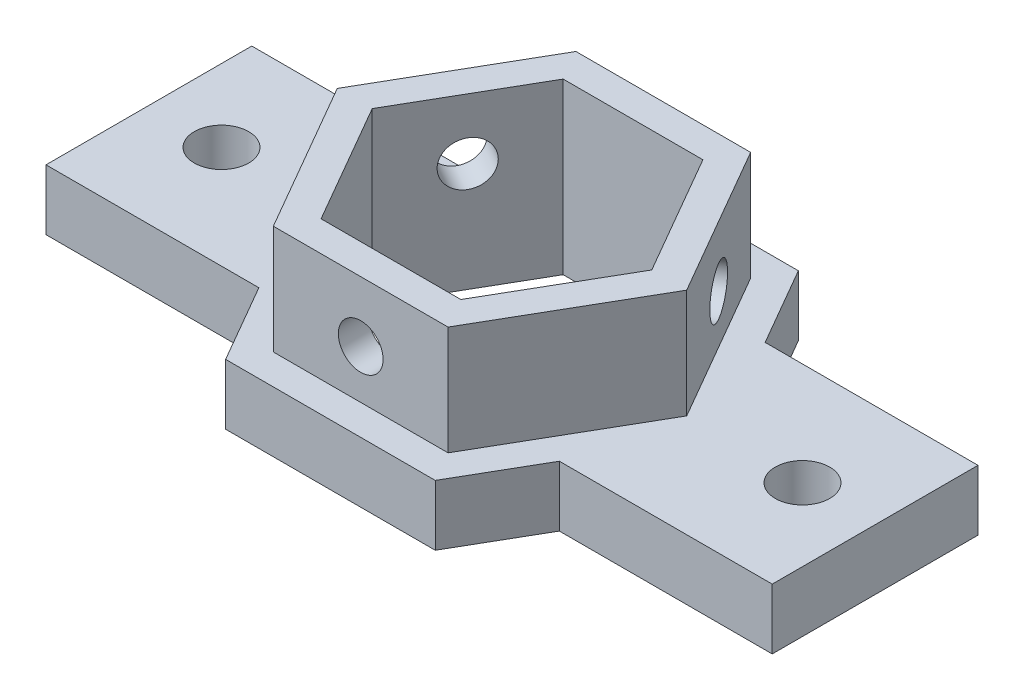
ISO-10303-21;
HEADER;
FILE_DESCRIPTION(('STEP AP214'),'2;1');
FILE_NAME('part.step','',(''),(''),'','','');
FILE_SCHEMA(('AUTOMOTIVE_DESIGN { 1 0 10303 214 1 1 1 1 }'));
ENDSEC;
DATA;
#1=APPLICATION_CONTEXT('core data for automotive mechanical design processes');
#2=APPLICATION_PROTOCOL_DEFINITION('international standard','automotive_design',2000,#1);
#3=PRODUCT_CONTEXT('',#1,'mechanical');
#4=PRODUCT('Part','Part','',(#3));
#5=PRODUCT_RELATED_PRODUCT_CATEGORY('part','',(#4));
#6=PRODUCT_DEFINITION_FORMATION('','',#4);
#7=PRODUCT_DEFINITION_CONTEXT('part definition',#1,'design');
#8=PRODUCT_DEFINITION('design','',#6,#7);
#9=PRODUCT_DEFINITION_SHAPE('','',#8);
#10=(LENGTH_UNIT() NAMED_UNIT(*) SI_UNIT(.MILLI.,.METRE.));
#11=(NAMED_UNIT(*) PLANE_ANGLE_UNIT() SI_UNIT($,.RADIAN.));
#12=(NAMED_UNIT(*) SI_UNIT($,.STERADIAN.) SOLID_ANGLE_UNIT());
#13=UNCERTAINTY_MEASURE_WITH_UNIT(LENGTH_MEASURE(1.E-05),#10,'distance_accuracy_value','');
#14=(GEOMETRIC_REPRESENTATION_CONTEXT(3) GLOBAL_UNCERTAINTY_ASSIGNED_CONTEXT((#13)) GLOBAL_UNIT_ASSIGNED_CONTEXT((#10,
#11,#12)) REPRESENTATION_CONTEXT('',''));
#15=CARTESIAN_POINT('',(0.,0.,0.));
#16=DIRECTION('',(0.,0.,1.));
#17=DIRECTION('',(1.,0.,0.));
#18=AXIS2_PLACEMENT_3D('',#15,#16,#17);
#19=CARTESIAN_POINT('',(-49.2201398007243,5.,0.0858649611754991));
#20=DIRECTION('',(0.,1.,0.));
#21=DIRECTION('',(0.,0.,1.));
#22=AXIS2_PLACEMENT_3D('',#19,#20,#21);
#23=PLANE('',#22);
#24=DIRECTION('',(0.5,0.,0.866025403784439));
#25=VECTOR('',#24,1.);
#26=CARTESIAN_POINT('',(-14.4337567297406,5.,0.));
#27=LINE('',#26,#25);
#28=CARTESIAN_POINT('',(-14.4337567297406,5.,0.));
#29=VERTEX_POINT('',#28);
#30=CARTESIAN_POINT('',(-7.21687836487032,5.,12.5));
#31=VERTEX_POINT('',#30);
#32=EDGE_CURVE('E337',#29,#31,#27,.T.);
#33=ORIENTED_EDGE('',*,*,#32,.F.);
#34=DIRECTION('',(-0.5,0.,0.866025403784439));
#35=VECTOR('',#34,1.);
#36=CARTESIAN_POINT('',(-7.21687836487032,5.,-12.5));
#37=LINE('',#36,#35);
#38=CARTESIAN_POINT('',(-7.21687836487032,5.,-12.5));
#39=VERTEX_POINT('',#38);
#40=EDGE_CURVE('E314',#39,#29,#37,.T.);
#41=ORIENTED_EDGE('',*,*,#40,.F.);
#42=DIRECTION('',(-1.,0.,0.));
#43=VECTOR('',#42,1.);
#44=CARTESIAN_POINT('',(7.21687836487032,5.,-12.5));
#45=LINE('',#44,#43);
#46=CARTESIAN_POINT('',(7.21687836487031,5.,-12.5));
#47=VERTEX_POINT('',#46);
#48=EDGE_CURVE('E319',#47,#39,#45,.T.);
#49=ORIENTED_EDGE('',*,*,#48,.F.);
#50=DIRECTION('',(-0.5,0.,-0.866025403784439));
#51=VECTOR('',#50,1.);
#52=CARTESIAN_POINT('',(14.4337567297406,5.,0.));
#53=LINE('',#52,#51);
#54=CARTESIAN_POINT('',(14.4337567297406,5.,0.));
#55=VERTEX_POINT('',#54);
#56=EDGE_CURVE('E346',#55,#47,#53,.T.);
#57=ORIENTED_EDGE('',*,*,#56,.F.);
#58=DIRECTION('',(0.5,0.,-0.866025403784439));
#59=VECTOR('',#58,1.);
#60=CARTESIAN_POINT('',(7.21687836487032,5.,12.5));
#61=LINE('',#60,#59);
#62=CARTESIAN_POINT('',(7.21687836487032,5.,12.5));
#63=VERTEX_POINT('',#62);
#64=EDGE_CURVE('E343',#63,#55,#61,.T.);
#65=ORIENTED_EDGE('',*,*,#64,.F.);
#66=DIRECTION('',(1.,0.,0.));
#67=VECTOR('',#66,1.);
#68=CARTESIAN_POINT('',(-7.21687836487032,5.,12.5));
#69=LINE('',#68,#67);
#70=EDGE_CURVE('E340',#31,#63,#69,.T.);
#71=ORIENTED_EDGE('',*,*,#70,.F.);
#72=EDGE_LOOP('',(#33,#41,#49,#57,#65,#71));
#73=FACE_BOUND('',#72,.T.);
#74=DIRECTION('',(-1.,0.,0.));
#75=VECTOR('',#74,1.);
#76=CARTESIAN_POINT('',(-49.2201398007243,5.,8.50000000000001));
#77=LINE('',#76,#75);
#78=CARTESIAN_POINT('',(-12.413030787577,5.,8.5));
#79=VERTEX_POINT('',#78);
#80=CARTESIAN_POINT('',(-30.,5.,8.5));
#81=VERTEX_POINT('',#80);
#82=EDGE_CURVE('E235',#79,#81,#77,.T.);
#83=ORIENTED_EDGE('',*,*,#82,.F.);
#84=DIRECTION('',(0.5,0.,0.866025403784439));
#85=VECTOR('',#84,1.);
#86=CARTESIAN_POINT('',(-25.2582353881112,5.,-13.7485470017428));
#87=LINE('',#86,#85);
#88=CARTESIAN_POINT('',(-8.66025403784439,5.,15.));
#89=VERTEX_POINT('',#88);
#90=EDGE_CURVE('E364',#79,#89,#87,.T.);
#91=ORIENTED_EDGE('',*,*,#90,.T.);
#92=DIRECTION('',(1.,0.,0.));
#93=VECTOR('',#92,1.);
#94=CARTESIAN_POINT('',(-49.2201398007243,5.,15.));
#95=LINE('',#94,#93);
#96=CARTESIAN_POINT('',(8.66025403784437,5.,15.));
#97=VERTEX_POINT('',#96);
#98=EDGE_CURVE('E366',#89,#97,#95,.T.);
#99=ORIENTED_EDGE('',*,*,#98,.T.);
#100=DIRECTION('',(0.5,0.,-0.866025403784439));
#101=VECTOR('',#100,1.);
#102=CARTESIAN_POINT('',(0.648165487749028,5.,28.877344443506));
#103=LINE('',#102,#101);
#104=CARTESIAN_POINT('',(12.4130307875769,5.,8.5));
#105=VERTEX_POINT('',#104);
#106=EDGE_CURVE('E368',#97,#105,#103,.T.);
#107=ORIENTED_EDGE('',*,*,#106,.T.);
#108=DIRECTION('',(-1.,0.,0.));
#109=VECTOR('',#108,1.);
#110=CARTESIAN_POINT('',(-49.2201398007243,5.,8.50000000000001));
#111=LINE('',#110,#109);
#112=CARTESIAN_POINT('',(30.,5.,8.49999999999999));
#113=VERTEX_POINT('',#112);
#114=EDGE_CURVE('E370',#113,#105,#111,.T.);
#115=ORIENTED_EDGE('',*,*,#114,.F.);
#116=DIRECTION('',(0.,0.,-1.));
#117=VECTOR('',#116,1.);
#118=CARTESIAN_POINT('',(30.,5.,0.0858649611754991));
#119=LINE('',#118,#117);
#120=CARTESIAN_POINT('',(30.,5.,-8.50000000000001));
#121=VERTEX_POINT('',#120);
#122=EDGE_CURVE('E373',#113,#121,#119,.T.);
#123=ORIENTED_EDGE('',*,*,#122,.T.);
#124=DIRECTION('',(-1.,0.,0.));
#125=VECTOR('',#124,1.);
#126=CARTESIAN_POINT('',(-49.2201398007243,5.,-8.49999999999999));
#127=LINE('',#126,#125);
#128=CARTESIAN_POINT('',(12.4130307875769,5.,-8.5));
#129=VERTEX_POINT('',#128);
#130=EDGE_CURVE('E375',#121,#129,#127,.T.);
#131=ORIENTED_EDGE('',*,*,#130,.T.);
#132=DIRECTION('',(-0.5,0.,-0.866025403784439));
#133=VECTOR('',#132,1.);
#134=CARTESIAN_POINT('',(0.722526725421946,5.,-28.7485470017428));
#135=LINE('',#134,#133);
#136=CARTESIAN_POINT('',(8.66025403784437,5.,-15.));
#137=VERTEX_POINT('',#136);
#138=EDGE_CURVE('E377',#129,#137,#135,.T.);
#139=ORIENTED_EDGE('',*,*,#138,.T.);
#140=DIRECTION('',(-1.,0.,0.));
#141=VECTOR('',#140,1.);
#142=CARTESIAN_POINT('',(-49.2201398007243,5.,-15.));
#143=LINE('',#142,#141);
#144=CARTESIAN_POINT('',(-8.6602540378444,5.,-15.));
#145=VERTEX_POINT('',#144);
#146=EDGE_CURVE('E168',#137,#145,#143,.T.);
#147=ORIENTED_EDGE('',*,*,#146,.T.);
#148=DIRECTION('',(-0.5,0.,0.866025403784439));
#149=VECTOR('',#148,1.);
#150=CARTESIAN_POINT('',(-25.3325966257841,5.,13.877344443506));
#151=LINE('',#150,#149);
#152=CARTESIAN_POINT('',(-12.413030787577,5.,-8.50000000000001));
#153=VERTEX_POINT('',#152);
#154=EDGE_CURVE('E159',#145,#153,#151,.T.);
#155=ORIENTED_EDGE('',*,*,#154,.T.);
#156=DIRECTION('',(-1.,0.,0.));
#157=VECTOR('',#156,1.);
#158=CARTESIAN_POINT('',(-49.2201398007243,5.,-8.5));
#159=LINE('',#158,#157);
#160=CARTESIAN_POINT('',(-30.,5.,-8.5));
#161=VERTEX_POINT('',#160);
#162=EDGE_CURVE('E165',#153,#161,#159,.T.);
#163=ORIENTED_EDGE('',*,*,#162,.T.);
#164=DIRECTION('',(0.,0.,-1.));
#165=VECTOR('',#164,1.);
#166=CARTESIAN_POINT('',(-30.,5.,0.0858649611754991));
#167=LINE('',#166,#165);
#168=EDGE_CURVE('E185',#81,#161,#167,.T.);
#169=ORIENTED_EDGE('',*,*,#168,.F.);
#170=EDGE_LOOP('',(#83,#91,#99,#107,#115,#123,#131,#139,#147,#155,#163,#169));
#171=FACE_BOUND('',#170,.T.);
#172=CARTESIAN_POINT('',(-24.,5.,0.));
#173=DIRECTION('',(0.,1.,0.));
#174=DIRECTION('',(0.,0.,1.));
#175=AXIS2_PLACEMENT_3D('',#172,#173,#174);
#176=CIRCLE('',#175,2.25);
#177=CARTESIAN_POINT('',(-24.,5.,2.25));
#178=VERTEX_POINT('',#177);
#179=EDGE_CURVE('E289',#178,#178,#176,.T.);
#180=ORIENTED_EDGE('',*,*,#179,.F.);
#181=EDGE_LOOP('',(#180));
#182=FACE_BOUND('',#181,.T.);
#183=CARTESIAN_POINT('',(24.,5.,0.));
#184=DIRECTION('',(0.,-1.,0.));
#185=DIRECTION('',(0.,0.,1.));
#186=AXIS2_PLACEMENT_3D('',#183,#184,#185);
#187=CIRCLE('',#186,2.25);
#188=CARTESIAN_POINT('',(24.,5.,2.25));
#189=VERTEX_POINT('',#188);
#190=EDGE_CURVE('E269',#189,#189,#187,.T.);
#191=ORIENTED_EDGE('',*,*,#190,.T.);
#192=EDGE_LOOP('',(#191));
#193=FACE_BOUND('',#192,.T.);
#194=ADVANCED_FACE('F33',(#73,#171,#182,#193),#23,.T.);
#195=CARTESIAN_POINT('',(-49.2201398007243,0.,0.0858649611754991));
#196=DIRECTION('',(0.,1.,0.));
#197=DIRECTION('',(0.,0.,1.));
#198=AXIS2_PLACEMENT_3D('',#195,#196,#197);
#199=PLANE('',#198);
#200=DIRECTION('',(-0.5,0.,0.866025403784439));
#201=VECTOR('',#200,1.);
#202=CARTESIAN_POINT('',(-21.0024696068619,0.,16.377344443506));
#203=LINE('',#202,#201);
#204=CARTESIAN_POINT('',(-5.77350269189626,0.,-10.));
#205=VERTEX_POINT('',#204);
#206=CARTESIAN_POINT('',(-11.5470053837925,0.,0.));
#207=VERTEX_POINT('',#206);
#208=EDGE_CURVE('E218',#205,#207,#203,.T.);
#209=ORIENTED_EDGE('',*,*,#208,.T.);
#210=DIRECTION('',(0.5,0.,0.866025403784438));
#211=VECTOR('',#210,1.);
#212=CARTESIAN_POINT('',(-20.928108369189,0.,-16.2485470017428));
#213=LINE('',#212,#211);
#214=CARTESIAN_POINT('',(-5.77350269189626,0.,9.99999999999999));
#215=VERTEX_POINT('',#214);
#216=EDGE_CURVE('E232',#207,#215,#213,.T.);
#217=ORIENTED_EDGE('',*,*,#216,.T.);
#218=DIRECTION('',(1.,0.,0.));
#219=VECTOR('',#218,1.);
#220=CARTESIAN_POINT('',(-49.2201398007243,0.,9.99999999999999));
#221=LINE('',#220,#219);
#222=CARTESIAN_POINT('',(5.77350269189624,0.,9.99999999999999));
#223=VERTEX_POINT('',#222);
#224=EDGE_CURVE('E229',#215,#223,#221,.T.);
#225=ORIENTED_EDGE('',*,*,#224,.T.);
#226=DIRECTION('',(0.5,0.,-0.866025403784439));
#227=VECTOR('',#226,1.);
#228=CARTESIAN_POINT('',(-3.68196153117317,0.,26.377344443506));
#229=LINE('',#228,#227);
#230=CARTESIAN_POINT('',(11.5470053837925,0.,0.));
#231=VERTEX_POINT('',#230);
#232=EDGE_CURVE('E226',#223,#231,#229,.T.);
#233=ORIENTED_EDGE('',*,*,#232,.T.);
#234=DIRECTION('',(-0.5,0.,-0.866025403784438));
#235=VECTOR('',#234,1.);
#236=CARTESIAN_POINT('',(-3.60760029350025,0.,-26.2485470017428));
#237=LINE('',#236,#235);
#238=CARTESIAN_POINT('',(5.77350269189624,0.,-10.));
#239=VERTEX_POINT('',#238);
#240=EDGE_CURVE('E223',#231,#239,#237,.T.);
#241=ORIENTED_EDGE('',*,*,#240,.T.);
#242=DIRECTION('',(-1.,0.,0.));
#243=VECTOR('',#242,1.);
#244=CARTESIAN_POINT('',(-49.2201398007243,0.,-10.));
#245=LINE('',#244,#243);
#246=EDGE_CURVE('E220',#239,#205,#245,.T.);
#247=ORIENTED_EDGE('',*,*,#246,.T.);
#248=EDGE_LOOP('',(#209,#217,#225,#233,#241,#247));
#249=FACE_BOUND('',#248,.T.);
#250=DIRECTION('',(-1.,0.,0.));
#251=VECTOR('',#250,1.);
#252=CARTESIAN_POINT('',(-49.2201398007243,0.,8.50000000000001));
#253=LINE('',#252,#251);
#254=CARTESIAN_POINT('',(-12.413030787577,0.,8.5));
#255=VERTEX_POINT('',#254);
#256=CARTESIAN_POINT('',(-30.,0.,8.5));
#257=VERTEX_POINT('',#256);
#258=EDGE_CURVE('E190',#255,#257,#253,.T.);
#259=ORIENTED_EDGE('',*,*,#258,.T.);
#260=DIRECTION('',(0.,0.,-1.));
#261=VECTOR('',#260,1.);
#262=CARTESIAN_POINT('',(-30.,0.,0.0858649611754991));
#263=LINE('',#262,#261);
#264=CARTESIAN_POINT('',(-30.,0.,-8.5));
#265=VERTEX_POINT('',#264);
#266=EDGE_CURVE('E215',#257,#265,#263,.T.);
#267=ORIENTED_EDGE('',*,*,#266,.T.);
#268=DIRECTION('',(-1.,0.,0.));
#269=VECTOR('',#268,1.);
#270=CARTESIAN_POINT('',(-49.2201398007243,0.,-8.5));
#271=LINE('',#270,#269);
#272=CARTESIAN_POINT('',(-12.413030787577,0.,-8.50000000000001));
#273=VERTEX_POINT('',#272);
#274=EDGE_CURVE('E213',#273,#265,#271,.T.);
#275=ORIENTED_EDGE('',*,*,#274,.F.);
#276=DIRECTION('',(-0.5,0.,0.866025403784439));
#277=VECTOR('',#276,1.);
#278=CARTESIAN_POINT('',(-25.3325966257841,0.,13.877344443506));
#279=LINE('',#278,#277);
#280=CARTESIAN_POINT('',(-8.6602540378444,0.,-15.));
#281=VERTEX_POINT('',#280);
#282=EDGE_CURVE('E177',#281,#273,#279,.T.);
#283=ORIENTED_EDGE('',*,*,#282,.F.);
#284=DIRECTION('',(-1.,0.,0.));
#285=VECTOR('',#284,1.);
#286=CARTESIAN_POINT('',(-49.2201398007243,0.,-15.));
#287=LINE('',#286,#285);
#288=CARTESIAN_POINT('',(8.66025403784437,0.,-15.));
#289=VERTEX_POINT('',#288);
#290=EDGE_CURVE('E210',#289,#281,#287,.T.);
#291=ORIENTED_EDGE('',*,*,#290,.F.);
#292=DIRECTION('',(-0.5,0.,-0.866025403784439));
#293=VECTOR('',#292,1.);
#294=CARTESIAN_POINT('',(0.722526725421946,0.,-28.7485470017428));
#295=LINE('',#294,#293);
#296=CARTESIAN_POINT('',(12.4130307875769,0.,-8.5));
#297=VERTEX_POINT('',#296);
#298=EDGE_CURVE('E208',#297,#289,#295,.T.);
#299=ORIENTED_EDGE('',*,*,#298,.F.);
#300=DIRECTION('',(-1.,0.,0.));
#301=VECTOR('',#300,1.);
#302=CARTESIAN_POINT('',(-49.2201398007243,0.,-8.49999999999999));
#303=LINE('',#302,#301);
#304=CARTESIAN_POINT('',(30.,0.,-8.50000000000001));
#305=VERTEX_POINT('',#304);
#306=EDGE_CURVE('E206',#305,#297,#303,.T.);
#307=ORIENTED_EDGE('',*,*,#306,.F.);
#308=DIRECTION('',(0.,0.,-1.));
#309=VECTOR('',#308,1.);
#310=CARTESIAN_POINT('',(30.,0.,0.0858649611754991));
#311=LINE('',#310,#309);
#312=CARTESIAN_POINT('',(30.,0.,8.49999999999999));
#313=VERTEX_POINT('',#312);
#314=EDGE_CURVE('E204',#313,#305,#311,.T.);
#315=ORIENTED_EDGE('',*,*,#314,.F.);
#316=DIRECTION('',(-1.,0.,0.));
#317=VECTOR('',#316,1.);
#318=CARTESIAN_POINT('',(-49.2201398007243,0.,8.50000000000001));
#319=LINE('',#318,#317);
#320=CARTESIAN_POINT('',(12.4130307875769,0.,8.5));
#321=VERTEX_POINT('',#320);
#322=EDGE_CURVE('E201',#313,#321,#319,.T.);
#323=ORIENTED_EDGE('',*,*,#322,.T.);
#324=DIRECTION('',(0.5,0.,-0.866025403784439));
#325=VECTOR('',#324,1.);
#326=CARTESIAN_POINT('',(0.648165487749028,0.,28.877344443506));
#327=LINE('',#326,#325);
#328=CARTESIAN_POINT('',(8.66025403784437,0.,15.));
#329=VERTEX_POINT('',#328);
#330=EDGE_CURVE('E198',#329,#321,#327,.T.);
#331=ORIENTED_EDGE('',*,*,#330,.F.);
#332=DIRECTION('',(1.,0.,0.));
#333=VECTOR('',#332,1.);
#334=CARTESIAN_POINT('',(-49.2201398007243,0.,15.));
#335=LINE('',#334,#333);
#336=CARTESIAN_POINT('',(-8.66025403784439,0.,15.));
#337=VERTEX_POINT('',#336);
#338=EDGE_CURVE('E196',#337,#329,#335,.T.);
#339=ORIENTED_EDGE('',*,*,#338,.F.);
#340=DIRECTION('',(0.5,0.,0.866025403784439));
#341=VECTOR('',#340,1.);
#342=CARTESIAN_POINT('',(-25.2582353881112,0.,-13.7485470017428));
#343=LINE('',#342,#341);
#344=EDGE_CURVE('E193',#255,#337,#343,.T.);
#345=ORIENTED_EDGE('',*,*,#344,.F.);
#346=EDGE_LOOP('',(#259,#267,#275,#283,#291,#299,#307,#315,#323,#331,#339,#345));
#347=FACE_BOUND('',#346,.T.);
#348=CARTESIAN_POINT('',(-24.,0.,0.));
#349=DIRECTION('',(0.,1.,0.));
#350=DIRECTION('',(0.,0.,1.));
#351=AXIS2_PLACEMENT_3D('',#348,#349,#350);
#352=CIRCLE('',#351,2.25);
#353=CARTESIAN_POINT('',(-24.,0.,2.25));
#354=VERTEX_POINT('',#353);
#355=EDGE_CURVE('E292',#354,#354,#352,.T.);
#356=ORIENTED_EDGE('',*,*,#355,.T.);
#357=EDGE_LOOP('',(#356));
#358=FACE_BOUND('',#357,.T.);
#359=CARTESIAN_POINT('',(24.,0.,0.));
#360=DIRECTION('',(0.,-1.,0.));
#361=DIRECTION('',(0.,0.,1.));
#362=AXIS2_PLACEMENT_3D('',#359,#360,#361);
#363=CIRCLE('',#362,2.25);
#364=CARTESIAN_POINT('',(24.,0.,2.25));
#365=VERTEX_POINT('',#364);
#366=EDGE_CURVE('E286',#365,#365,#363,.T.);
#367=ORIENTED_EDGE('',*,*,#366,.F.);
#368=EDGE_LOOP('',(#367));
#369=FACE_BOUND('',#368,.T.);
#370=ADVANCED_FACE('F389',(#249,#347,#358,#369),#199,.F.);
#371=CARTESIAN_POINT('',(-21.0024696068619,5.,16.377344443506));
#372=DIRECTION('',(0.866025403784439,0.,0.5));
#373=DIRECTION('',(0.5,0.,-0.866025403784439));
#374=AXIS2_PLACEMENT_3D('',#371,#372,#373);
#375=PLANE('',#374);
#376=CARTESIAN_POINT('',(-8.66025403784438,9.,-5.00000000000002));
#377=DIRECTION('',(0.866025403784439,0.,0.5));
#378=DIRECTION('',(0.5,0.,-0.866025403784439));
#379=AXIS2_PLACEMENT_3D('',#376,#377,#378);
#380=CIRCLE('',#379,1.85);
#381=CARTESIAN_POINT('',(-7.73525403784438,9.,-6.60214699700123));
#382=VERTEX_POINT('',#381);
#383=EDGE_CURVE('E283',#382,#382,#380,.F.);
#384=ORIENTED_EDGE('',*,*,#383,.T.);
#385=EDGE_LOOP('',(#384));
#386=FACE_BOUND('',#385,.T.);
#387=ORIENTED_EDGE('',*,*,#208,.F.);
#388=DIRECTION('',(0.,-1.,0.));
#389=VECTOR('',#388,1.);
#390=CARTESIAN_POINT('',(-5.77350269189626,5.,-10.));
#391=LINE('',#390,#389);
#392=CARTESIAN_POINT('',(-5.77350269189638,14.,-9.99999999999993));
#393=VERTEX_POINT('',#392);
#394=EDGE_CURVE('E11',#393,#205,#391,.T.);
#395=ORIENTED_EDGE('',*,*,#394,.F.);
#396=DIRECTION('',(-0.499999999999994,0.,0.866025403784442));
#397=VECTOR('',#396,1.);
#398=CARTESIAN_POINT('',(-5.77350269189638,14.,-9.99999999999993));
#399=LINE('',#398,#397);
#400=CARTESIAN_POINT('',(-11.5470053837925,14.,0.));
#401=VERTEX_POINT('',#400);
#402=EDGE_CURVE('E295',#393,#401,#399,.T.);
#403=ORIENTED_EDGE('',*,*,#402,.T.);
#404=DIRECTION('',(0.,-1.,0.));
#405=VECTOR('',#404,1.);
#406=CARTESIAN_POINT('',(-11.5470053837925,5.,0.));
#407=LINE('',#406,#405);
#408=EDGE_CURVE('E122',#401,#207,#407,.T.);
#409=ORIENTED_EDGE('',*,*,#408,.T.);
#410=EDGE_LOOP('',(#387,#395,#403,#409));
#411=FACE_BOUND('',#410,.T.);
#412=ADVANCED_FACE('F412',(#386,#411),#375,.T.);
#413=CARTESIAN_POINT('',(-49.2201398007243,5.,-10.));
#414=DIRECTION('',(0.,0.,1.));
#415=DIRECTION('',(1.,0.,0.));
#416=AXIS2_PLACEMENT_3D('',#413,#414,#415);
#417=PLANE('',#416);
#418=ORIENTED_EDGE('',*,*,#246,.F.);
#419=DIRECTION('',(0.,-1.,0.));
#420=VECTOR('',#419,1.);
#421=CARTESIAN_POINT('',(5.77350269189624,5.,-10.));
#422=LINE('',#421,#420);
#423=CARTESIAN_POINT('',(5.77350269189616,14.,-10.0000000000001));
#424=VERTEX_POINT('',#423);
#425=EDGE_CURVE('E42',#424,#239,#422,.T.);
#426=ORIENTED_EDGE('',*,*,#425,.F.);
#427=DIRECTION('',(-1.,0.,0.));
#428=VECTOR('',#427,1.);
#429=CARTESIAN_POINT('',(5.77350269189616,14.,-10.0000000000001));
#430=LINE('',#429,#428);
#431=EDGE_CURVE('E311',#424,#393,#430,.T.);
#432=ORIENTED_EDGE('',*,*,#431,.T.);
#433=ORIENTED_EDGE('',*,*,#394,.T.);
#434=EDGE_LOOP('',(#418,#426,#432,#433));
#435=FACE_BOUND('',#434,.T.);
#436=ADVANCED_FACE('F431',(#435),#417,.T.);
#437=CARTESIAN_POINT('',(-3.60760029350025,5.,-26.2485470017428));
#438=DIRECTION('',(-0.866025403784438,0.,0.5));
#439=DIRECTION('',(0.5,0.,0.866025403784438));
#440=AXIS2_PLACEMENT_3D('',#437,#438,#439);
#441=PLANE('',#440);
#442=CARTESIAN_POINT('',(8.66025403784437,9.,-5.));
#443=DIRECTION('',(-0.866025403784438,0.,0.5));
#444=DIRECTION('',(0.5,0.,0.866025403784438));
#445=AXIS2_PLACEMENT_3D('',#442,#443,#444);
#446=CIRCLE('',#445,2.);
#447=CARTESIAN_POINT('',(9.66025403784437,9.,-3.26794919243113));
#448=VERTEX_POINT('',#447);
#449=EDGE_CURVE('E273',#448,#448,#446,.F.);
#450=ORIENTED_EDGE('',*,*,#449,.T.);
#451=EDGE_LOOP('',(#450));
#452=FACE_BOUND('',#451,.T.);
#453=ORIENTED_EDGE('',*,*,#240,.F.);
#454=DIRECTION('',(0.,-1.,0.));
#455=VECTOR('',#454,1.);
#456=CARTESIAN_POINT('',(11.5470053837925,5.,0.));
#457=LINE('',#456,#455);
#458=CARTESIAN_POINT('',(11.5470053837925,14.,0.));
#459=VERTEX_POINT('',#458);
#460=EDGE_CURVE('E241',#459,#231,#457,.T.);
#461=ORIENTED_EDGE('',*,*,#460,.F.);
#462=DIRECTION('',(-0.500000000000008,0.,-0.866025403784434));
#463=VECTOR('',#462,1.);
#464=CARTESIAN_POINT('',(11.5470053837925,14.,0.));
#465=LINE('',#464,#463);
#466=EDGE_CURVE('E308',#459,#424,#465,.T.);
#467=ORIENTED_EDGE('',*,*,#466,.T.);
#468=ORIENTED_EDGE('',*,*,#425,.T.);
#469=EDGE_LOOP('',(#453,#461,#467,#468));
#470=FACE_BOUND('',#469,.T.);
#471=ADVANCED_FACE('F427',(#452,#470),#441,.T.);
#472=CARTESIAN_POINT('',(-3.68196153117317,5.,26.377344443506));
#473=DIRECTION('',(-0.866025403784439,0.,-0.5));
#474=DIRECTION('',(-0.5,0.,0.866025403784439));
#475=AXIS2_PLACEMENT_3D('',#472,#473,#474);
#476=PLANE('',#475);
#477=ORIENTED_EDGE('',*,*,#232,.F.);
#478=DIRECTION('',(0.,-1.,0.));
#479=VECTOR('',#478,1.);
#480=CARTESIAN_POINT('',(5.77350269189624,5.,9.99999999999999));
#481=LINE('',#480,#479);
#482=CARTESIAN_POINT('',(5.77350269189631,14.,9.99999999999997));
#483=VERTEX_POINT('',#482);
#484=EDGE_CURVE('E239',#483,#223,#481,.T.);
#485=ORIENTED_EDGE('',*,*,#484,.F.);
#486=DIRECTION('',(0.499999999999994,0.,-0.866025403784442));
#487=VECTOR('',#486,1.);
#488=CARTESIAN_POINT('',(5.77350269189631,14.,9.99999999999997));
#489=LINE('',#488,#487);
#490=EDGE_CURVE('E305',#483,#459,#489,.T.);
#491=ORIENTED_EDGE('',*,*,#490,.T.);
#492=ORIENTED_EDGE('',*,*,#460,.T.);
#493=EDGE_LOOP('',(#477,#485,#491,#492));
#494=FACE_BOUND('',#493,.T.);
#495=ADVANCED_FACE('F403',(#494),#476,.T.);
#496=CARTESIAN_POINT('',(-49.2201398007243,5.,9.99999999999999));
#497=DIRECTION('',(0.,0.,-1.));
#498=DIRECTION('',(-1.,0.,0.));
#499=AXIS2_PLACEMENT_3D('',#496,#497,#498);
#500=PLANE('',#499);
#501=CARTESIAN_POINT('',(0.,9.,9.99999999999999));
#502=DIRECTION('',(0.,0.,-1.));
#503=DIRECTION('',(-1.,0.,0.));
#504=AXIS2_PLACEMENT_3D('',#501,#502,#503);
#505=CIRCLE('',#504,1.85);
#506=CARTESIAN_POINT('',(-1.85,9.,9.99999999999999));
#507=VERTEX_POINT('',#506);
#508=EDGE_CURVE('E270',#507,#507,#505,.F.);
#509=ORIENTED_EDGE('',*,*,#508,.T.);
#510=EDGE_LOOP('',(#509));
#511=FACE_BOUND('',#510,.T.);
#512=ORIENTED_EDGE('',*,*,#224,.F.);
#513=DIRECTION('',(0.,-1.,0.));
#514=VECTOR('',#513,1.);
#515=CARTESIAN_POINT('',(-5.77350269189626,5.,9.99999999999999));
#516=LINE('',#515,#514);
#517=CARTESIAN_POINT('',(-5.77350269189623,14.,10.));
#518=VERTEX_POINT('',#517);
#519=EDGE_CURVE('E237',#518,#215,#516,.T.);
#520=ORIENTED_EDGE('',*,*,#519,.F.);
#521=DIRECTION('',(1.,0.,0.));
#522=VECTOR('',#521,1.);
#523=CARTESIAN_POINT('',(-5.77350269189623,14.,10.));
#524=LINE('',#523,#522);
#525=EDGE_CURVE('E302',#518,#483,#524,.T.);
#526=ORIENTED_EDGE('',*,*,#525,.T.);
#527=ORIENTED_EDGE('',*,*,#484,.T.);
#528=EDGE_LOOP('',(#512,#520,#526,#527));
#529=FACE_BOUND('',#528,.T.);
#530=ADVANCED_FACE('F396',(#511,#529),#500,.T.);
#531=CARTESIAN_POINT('',(-49.2201398007243,5.,8.50000000000001));
#532=DIRECTION('',(0.,0.,1.));
#533=DIRECTION('',(1.,0.,0.));
#534=AXIS2_PLACEMENT_3D('',#531,#532,#533);
#535=PLANE('',#534);
#536=ORIENTED_EDGE('',*,*,#258,.F.);
#537=DIRECTION('',(0.,-1.,0.));
#538=VECTOR('',#537,1.);
#539=CARTESIAN_POINT('',(-12.413030787577,5.,8.5));
#540=LINE('',#539,#538);
#541=EDGE_CURVE('E129',#79,#255,#540,.T.);
#542=ORIENTED_EDGE('',*,*,#541,.F.);
#543=ORIENTED_EDGE('',*,*,#82,.T.);
#544=DIRECTION('',(0.,-1.,0.));
#545=VECTOR('',#544,1.);
#546=CARTESIAN_POINT('',(-30.,5.,8.5));
#547=LINE('',#546,#545);
#548=EDGE_CURVE('E59',#81,#257,#547,.T.);
#549=ORIENTED_EDGE('',*,*,#548,.T.);
#550=EDGE_LOOP('',(#536,#542,#543,#549));
#551=FACE_BOUND('',#550,.T.);
#552=ADVANCED_FACE('F35',(#551),#535,.T.);
#553=CARTESIAN_POINT('',(-25.2582353881112,5.,-13.7485470017428));
#554=DIRECTION('',(0.866025403784438,0.,-0.5));
#555=DIRECTION('',(-0.5,0.,-0.866025403784439));
#556=AXIS2_PLACEMENT_3D('',#553,#554,#555);
#557=PLANE('',#556);
#558=ORIENTED_EDGE('',*,*,#344,.T.);
#559=DIRECTION('',(0.,-1.,0.));
#560=VECTOR('',#559,1.);
#561=CARTESIAN_POINT('',(-8.66025403784439,5.,15.));
#562=LINE('',#561,#560);
#563=EDGE_CURVE('E263',#89,#337,#562,.T.);
#564=ORIENTED_EDGE('',*,*,#563,.F.);
#565=ORIENTED_EDGE('',*,*,#90,.F.);
#566=ORIENTED_EDGE('',*,*,#541,.T.);
#567=EDGE_LOOP('',(#558,#564,#565,#566));
#568=FACE_BOUND('',#567,.T.);
#569=ADVANCED_FACE('F395',(#568),#557,.F.);
#570=CARTESIAN_POINT('',(-49.2201398007243,5.,15.));
#571=DIRECTION('',(0.,0.,-1.));
#572=DIRECTION('',(-1.,0.,0.));
#573=AXIS2_PLACEMENT_3D('',#570,#571,#572);
#574=PLANE('',#573);
#575=ORIENTED_EDGE('',*,*,#338,.T.);
#576=DIRECTION('',(0.,-1.,0.));
#577=VECTOR('',#576,1.);
#578=CARTESIAN_POINT('',(8.66025403784437,5.,15.));
#579=LINE('',#578,#577);
#580=EDGE_CURVE('E260',#97,#329,#579,.T.);
#581=ORIENTED_EDGE('',*,*,#580,.F.);
#582=ORIENTED_EDGE('',*,*,#98,.F.);
#583=ORIENTED_EDGE('',*,*,#563,.T.);
#584=EDGE_LOOP('',(#575,#581,#582,#583));
#585=FACE_BOUND('',#584,.T.);
#586=ADVANCED_FACE('F401',(#585),#574,.F.);
#587=CARTESIAN_POINT('',(0.648165487749028,5.,28.877344443506));
#588=DIRECTION('',(-0.866025403784439,0.,-0.5));
#589=DIRECTION('',(-0.5,0.,0.866025403784439));
#590=AXIS2_PLACEMENT_3D('',#587,#588,#589);
#591=PLANE('',#590);
#592=ORIENTED_EDGE('',*,*,#330,.T.);
#593=DIRECTION('',(0.,-1.,0.));
#594=VECTOR('',#593,1.);
#595=CARTESIAN_POINT('',(12.4130307875769,5.,8.5));
#596=LINE('',#595,#594);
#597=EDGE_CURVE('E258',#105,#321,#596,.T.);
#598=ORIENTED_EDGE('',*,*,#597,.F.);
#599=ORIENTED_EDGE('',*,*,#106,.F.);
#600=ORIENTED_EDGE('',*,*,#580,.T.);
#601=EDGE_LOOP('',(#592,#598,#599,#600));
#602=FACE_BOUND('',#601,.T.);
#603=ADVANCED_FACE('F459',(#602),#591,.F.);
#604=CARTESIAN_POINT('',(-49.2201398007243,5.,8.50000000000001));
#605=DIRECTION('',(0.,0.,1.));
#606=DIRECTION('',(1.,0.,0.));
#607=AXIS2_PLACEMENT_3D('',#604,#605,#606);
#608=PLANE('',#607);
#609=ORIENTED_EDGE('',*,*,#322,.F.);
#610=DIRECTION('',(0.,-1.,0.));
#611=VECTOR('',#610,1.);
#612=CARTESIAN_POINT('',(30.,5.,8.49999999999999));
#613=LINE('',#612,#611);
#614=EDGE_CURVE('E256',#113,#313,#613,.T.);
#615=ORIENTED_EDGE('',*,*,#614,.F.);
#616=ORIENTED_EDGE('',*,*,#114,.T.);
#617=ORIENTED_EDGE('',*,*,#597,.T.);
#618=EDGE_LOOP('',(#609,#615,#616,#617));
#619=FACE_BOUND('',#618,.T.);
#620=ADVANCED_FACE('F455',(#619),#608,.T.);
#621=CARTESIAN_POINT('',(30.,5.,0.0858649611754991));
#622=DIRECTION('',(-1.,0.,0.));
#623=DIRECTION('',(0.,0.,1.));
#624=AXIS2_PLACEMENT_3D('',#621,#622,#623);
#625=PLANE('',#624);
#626=ORIENTED_EDGE('',*,*,#314,.T.);
#627=DIRECTION('',(0.,-1.,0.));
#628=VECTOR('',#627,1.);
#629=CARTESIAN_POINT('',(30.,5.,-8.50000000000001));
#630=LINE('',#629,#628);
#631=EDGE_CURVE('E253',#121,#305,#630,.T.);
#632=ORIENTED_EDGE('',*,*,#631,.F.);
#633=ORIENTED_EDGE('',*,*,#122,.F.);
#634=ORIENTED_EDGE('',*,*,#614,.T.);
#635=EDGE_LOOP('',(#626,#632,#633,#634));
#636=FACE_BOUND('',#635,.T.);
#637=ADVANCED_FACE('F451',(#636),#625,.F.);
#638=CARTESIAN_POINT('',(-49.2201398007243,5.,-8.49999999999999));
#639=DIRECTION('',(0.,0.,1.));
#640=DIRECTION('',(1.,0.,0.));
#641=AXIS2_PLACEMENT_3D('',#638,#639,#640);
#642=PLANE('',#641);
#643=ORIENTED_EDGE('',*,*,#306,.T.);
#644=DIRECTION('',(0.,-1.,0.));
#645=VECTOR('',#644,1.);
#646=CARTESIAN_POINT('',(12.4130307875769,5.,-8.5));
#647=LINE('',#646,#645);
#648=EDGE_CURVE('E250',#129,#297,#647,.T.);
#649=ORIENTED_EDGE('',*,*,#648,.F.);
#650=ORIENTED_EDGE('',*,*,#130,.F.);
#651=ORIENTED_EDGE('',*,*,#631,.T.);
#652=EDGE_LOOP('',(#643,#649,#650,#651));
#653=FACE_BOUND('',#652,.T.);
#654=ADVANCED_FACE('F448',(#653),#642,.F.);
#655=CARTESIAN_POINT('',(0.722526725421946,5.,-28.7485470017428));
#656=DIRECTION('',(-0.866025403784438,0.,0.5));
#657=DIRECTION('',(0.5,0.,0.866025403784439));
#658=AXIS2_PLACEMENT_3D('',#655,#656,#657);
#659=PLANE('',#658);
#660=ORIENTED_EDGE('',*,*,#298,.T.);
#661=DIRECTION('',(0.,-1.,0.));
#662=VECTOR('',#661,1.);
#663=CARTESIAN_POINT('',(8.66025403784437,5.,-15.));
#664=LINE('',#663,#662);
#665=EDGE_CURVE('E247',#137,#289,#664,.T.);
#666=ORIENTED_EDGE('',*,*,#665,.F.);
#667=ORIENTED_EDGE('',*,*,#138,.F.);
#668=ORIENTED_EDGE('',*,*,#648,.T.);
#669=EDGE_LOOP('',(#660,#666,#667,#668));
#670=FACE_BOUND('',#669,.T.);
#671=ADVANCED_FACE('F383',(#670),#659,.F.);
#672=CARTESIAN_POINT('',(-49.2201398007243,5.,-15.));
#673=DIRECTION('',(0.,0.,1.));
#674=DIRECTION('',(1.,0.,0.));
#675=AXIS2_PLACEMENT_3D('',#672,#673,#674);
#676=PLANE('',#675);
#677=ORIENTED_EDGE('',*,*,#290,.T.);
#678=DIRECTION('',(0.,-1.,0.));
#679=VECTOR('',#678,1.);
#680=CARTESIAN_POINT('',(-8.6602540378444,5.,-15.));
#681=LINE('',#680,#679);
#682=EDGE_CURVE('E181',#145,#281,#681,.T.);
#683=ORIENTED_EDGE('',*,*,#682,.F.);
#684=ORIENTED_EDGE('',*,*,#146,.F.);
#685=ORIENTED_EDGE('',*,*,#665,.T.);
#686=EDGE_LOOP('',(#677,#683,#684,#685));
#687=FACE_BOUND('',#686,.T.);
#688=ADVANCED_FACE('F387',(#687),#676,.F.);
#689=CARTESIAN_POINT('',(-25.3325966257841,5.,13.877344443506));
#690=DIRECTION('',(0.866025403784439,0.,0.5));
#691=DIRECTION('',(0.5,0.,-0.866025403784439));
#692=AXIS2_PLACEMENT_3D('',#689,#690,#691);
#693=PLANE('',#692);
#694=ORIENTED_EDGE('',*,*,#282,.T.);
#695=DIRECTION('',(0.,-1.,0.));
#696=VECTOR('',#695,1.);
#697=CARTESIAN_POINT('',(-12.413030787577,5.,-8.50000000000001));
#698=LINE('',#697,#696);
#699=EDGE_CURVE('E174',#153,#273,#698,.T.);
#700=ORIENTED_EDGE('',*,*,#699,.F.);
#701=ORIENTED_EDGE('',*,*,#154,.F.);
#702=ORIENTED_EDGE('',*,*,#682,.T.);
#703=EDGE_LOOP('',(#694,#700,#701,#702));
#704=FACE_BOUND('',#703,.T.);
#705=ADVANCED_FACE('F175',(#704),#693,.F.);
#706=CARTESIAN_POINT('',(-49.2201398007243,5.,-8.5));
#707=DIRECTION('',(0.,0.,1.));
#708=DIRECTION('',(1.,0.,0.));
#709=AXIS2_PLACEMENT_3D('',#706,#707,#708);
#710=PLANE('',#709);
#711=ORIENTED_EDGE('',*,*,#274,.T.);
#712=DIRECTION('',(0.,-1.,0.));
#713=VECTOR('',#712,1.);
#714=CARTESIAN_POINT('',(-30.,5.,-8.5));
#715=LINE('',#714,#713);
#716=EDGE_CURVE('E182',#161,#265,#715,.T.);
#717=ORIENTED_EDGE('',*,*,#716,.F.);
#718=ORIENTED_EDGE('',*,*,#162,.F.);
#719=ORIENTED_EDGE('',*,*,#699,.T.);
#720=EDGE_LOOP('',(#711,#717,#718,#719));
#721=FACE_BOUND('',#720,.T.);
#722=ADVANCED_FACE('F184',(#721),#710,.F.);
#723=CARTESIAN_POINT('',(-30.,5.,0.0858649611754991));
#724=DIRECTION('',(-1.,0.,0.));
#725=DIRECTION('',(0.,0.,1.));
#726=AXIS2_PLACEMENT_3D('',#723,#724,#725);
#727=PLANE('',#726);
#728=ORIENTED_EDGE('',*,*,#266,.F.);
#729=ORIENTED_EDGE('',*,*,#548,.F.);
#730=ORIENTED_EDGE('',*,*,#168,.T.);
#731=ORIENTED_EDGE('',*,*,#716,.T.);
#732=EDGE_LOOP('',(#728,#729,#730,#731));
#733=FACE_BOUND('',#732,.T.);
#734=ADVANCED_FACE('F392',(#733),#727,.T.);
#735=CARTESIAN_POINT('',(-20.928108369189,5.,-16.2485470017428));
#736=DIRECTION('',(0.866025403784438,0.,-0.5));
#737=DIRECTION('',(-0.5,0.,-0.866025403784438));
#738=AXIS2_PLACEMENT_3D('',#735,#736,#737);
#739=PLANE('',#738);
#740=ORIENTED_EDGE('',*,*,#216,.F.);
#741=ORIENTED_EDGE('',*,*,#408,.F.);
#742=DIRECTION('',(0.500000000000001,0.,0.866025403784438));
#743=VECTOR('',#742,1.);
#744=CARTESIAN_POINT('',(-11.5470053837925,14.,0.));
#745=LINE('',#744,#743);
#746=EDGE_CURVE('E299',#401,#518,#745,.T.);
#747=ORIENTED_EDGE('',*,*,#746,.T.);
#748=ORIENTED_EDGE('',*,*,#519,.T.);
#749=EDGE_LOOP('',(#740,#741,#747,#748));
#750=FACE_BOUND('',#749,.T.);
#751=ADVANCED_FACE('F420',(#750),#739,.T.);
#752=CARTESIAN_POINT('',(-14.4337567297406,14.,0.));
#753=DIRECTION('',(0.,1.,0.));
#754=DIRECTION('',(0.,0.,1.));
#755=AXIS2_PLACEMENT_3D('',#752,#753,#754);
#756=PLANE('',#755);
#757=DIRECTION('',(-0.5,0.,0.866025403784439));
#758=VECTOR('',#757,1.);
#759=CARTESIAN_POINT('',(-7.21687836487032,14.,-12.5));
#760=LINE('',#759,#758);
#761=CARTESIAN_POINT('',(-7.21687836487032,14.,-12.5));
#762=VERTEX_POINT('',#761);
#763=CARTESIAN_POINT('',(-14.4337567297406,14.,0.));
#764=VERTEX_POINT('',#763);
#765=EDGE_CURVE('E315',#762,#764,#760,.T.);
#766=ORIENTED_EDGE('',*,*,#765,.T.);
#767=DIRECTION('',(0.5,0.,0.866025403784439));
#768=VECTOR('',#767,1.);
#769=CARTESIAN_POINT('',(-14.4337567297406,14.,0.));
#770=LINE('',#769,#768);
#771=CARTESIAN_POINT('',(-7.21687836487032,14.,12.5));
#772=VERTEX_POINT('',#771);
#773=EDGE_CURVE('E318',#764,#772,#770,.T.);
#774=ORIENTED_EDGE('',*,*,#773,.T.);
#775=DIRECTION('',(1.,0.,0.));
#776=VECTOR('',#775,1.);
#777=CARTESIAN_POINT('',(-7.21687836487032,14.,12.5));
#778=LINE('',#777,#776);
#779=CARTESIAN_POINT('',(7.21687836487032,14.,12.5));
#780=VERTEX_POINT('',#779);
#781=EDGE_CURVE('E322',#772,#780,#778,.T.);
#782=ORIENTED_EDGE('',*,*,#781,.T.);
#783=DIRECTION('',(0.5,0.,-0.866025403784439));
#784=VECTOR('',#783,1.);
#785=CARTESIAN_POINT('',(7.21687836487032,14.,12.5));
#786=LINE('',#785,#784);
#787=CARTESIAN_POINT('',(14.4337567297406,14.,0.));
#788=VERTEX_POINT('',#787);
#789=EDGE_CURVE('E325',#780,#788,#786,.T.);
#790=ORIENTED_EDGE('',*,*,#789,.T.);
#791=DIRECTION('',(-0.5,0.,-0.866025403784439));
#792=VECTOR('',#791,1.);
#793=CARTESIAN_POINT('',(14.4337567297406,14.,0.));
#794=LINE('',#793,#792);
#795=CARTESIAN_POINT('',(7.21687836487032,14.,-12.5));
#796=VERTEX_POINT('',#795);
#797=EDGE_CURVE('E328',#788,#796,#794,.T.);
#798=ORIENTED_EDGE('',*,*,#797,.T.);
#799=DIRECTION('',(-1.,0.,0.));
#800=VECTOR('',#799,1.);
#801=CARTESIAN_POINT('',(7.21687836487032,14.,-12.5));
#802=LINE('',#801,#800);
#803=EDGE_CURVE('E331',#796,#762,#802,.T.);
#804=ORIENTED_EDGE('',*,*,#803,.T.);
#805=EDGE_LOOP('',(#766,#774,#782,#790,#798,#804));
#806=FACE_BOUND('',#805,.T.);
#807=ORIENTED_EDGE('',*,*,#746,.F.);
#808=ORIENTED_EDGE('',*,*,#402,.F.);
#809=ORIENTED_EDGE('',*,*,#431,.F.);
#810=ORIENTED_EDGE('',*,*,#466,.F.);
#811=ORIENTED_EDGE('',*,*,#490,.F.);
#812=ORIENTED_EDGE('',*,*,#525,.F.);
#813=EDGE_LOOP('',(#807,#808,#809,#810,#811,#812));
#814=FACE_BOUND('',#813,.T.);
#815=ADVANCED_FACE('F422',(#806,#814),#756,.T.);
#816=CARTESIAN_POINT('',(-7.21687836487032,14.,-12.5));
#817=DIRECTION('',(0.866025403784439,0.,0.5));
#818=DIRECTION('',(0.5,0.,-0.866025403784439));
#819=AXIS2_PLACEMENT_3D('',#816,#817,#818);
#820=PLANE('',#819);
#821=CARTESIAN_POINT('',(-10.8253175473055,9.,-6.25000000000001));
#822=DIRECTION('',(0.866025403784439,0.,0.5));
#823=DIRECTION('',(0.5,0.,-0.866025403784439));
#824=AXIS2_PLACEMENT_3D('',#821,#822,#823);
#825=CIRCLE('',#824,1.85);
#826=CARTESIAN_POINT('',(-9.90031754730547,9.,-7.85214699700123));
#827=VERTEX_POINT('',#826);
#828=EDGE_CURVE('E37',#827,#827,#825,.T.);
#829=ORIENTED_EDGE('',*,*,#828,.T.);
#830=EDGE_LOOP('',(#829));
#831=FACE_BOUND('',#830,.T.);
#832=ORIENTED_EDGE('',*,*,#40,.T.);
#833=DIRECTION('',(0.,-1.,0.));
#834=VECTOR('',#833,1.);
#835=CARTESIAN_POINT('',(-14.4337567297406,14.,0.));
#836=LINE('',#835,#834);
#837=EDGE_CURVE('E194',#764,#29,#836,.T.);
#838=ORIENTED_EDGE('',*,*,#837,.F.);
#839=ORIENTED_EDGE('',*,*,#765,.F.);
#840=DIRECTION('',(0.,-1.,0.));
#841=VECTOR('',#840,1.);
#842=CARTESIAN_POINT('',(-7.21687836487032,14.,-12.5));
#843=LINE('',#842,#841);
#844=EDGE_CURVE('E334',#762,#39,#843,.T.);
#845=ORIENTED_EDGE('',*,*,#844,.T.);
#846=EDGE_LOOP('',(#832,#838,#839,#845));
#847=FACE_BOUND('',#846,.T.);
#848=ADVANCED_FACE('F417',(#831,#847),#820,.F.);
#849=CARTESIAN_POINT('',(-14.4337567297406,14.,0.));
#850=DIRECTION('',(0.866025403784439,0.,-0.5));
#851=DIRECTION('',(-0.5,0.,-0.866025403784439));
#852=AXIS2_PLACEMENT_3D('',#849,#850,#851);
#853=PLANE('',#852);
#854=ORIENTED_EDGE('',*,*,#32,.T.);
#855=DIRECTION('',(0.,-1.,0.));
#856=VECTOR('',#855,1.);
#857=CARTESIAN_POINT('',(-7.21687836487032,14.,12.5));
#858=LINE('',#857,#856);
#859=EDGE_CURVE('E358',#772,#31,#858,.T.);
#860=ORIENTED_EDGE('',*,*,#859,.F.);
#861=ORIENTED_EDGE('',*,*,#773,.F.);
#862=ORIENTED_EDGE('',*,*,#837,.T.);
#863=EDGE_LOOP('',(#854,#860,#861,#862));
#864=FACE_BOUND('',#863,.T.);
#865=ADVANCED_FACE('F538',(#864),#853,.F.);
#866=CARTESIAN_POINT('',(-7.21687836487032,14.,12.5));
#867=DIRECTION('',(0.,0.,-1.));
#868=DIRECTION('',(-1.,0.,0.));
#869=AXIS2_PLACEMENT_3D('',#866,#867,#868);
#870=PLANE('',#869);
#871=CARTESIAN_POINT('',(0.,9.,12.5));
#872=DIRECTION('',(0.,0.,-1.));
#873=DIRECTION('',(-1.,0.,0.));
#874=AXIS2_PLACEMENT_3D('',#871,#872,#873);
#875=CIRCLE('',#874,1.85);
#876=CARTESIAN_POINT('',(-1.85,9.,12.5));
#877=VERTEX_POINT('',#876);
#878=EDGE_CURVE('E267',#877,#877,#875,.T.);
#879=ORIENTED_EDGE('',*,*,#878,.T.);
#880=EDGE_LOOP('',(#879));
#881=FACE_BOUND('',#880,.T.);
#882=ORIENTED_EDGE('',*,*,#70,.T.);
#883=DIRECTION('',(0.,-1.,0.));
#884=VECTOR('',#883,1.);
#885=CARTESIAN_POINT('',(7.21687836487032,14.,12.5));
#886=LINE('',#885,#884);
#887=EDGE_CURVE('E355',#780,#63,#886,.T.);
#888=ORIENTED_EDGE('',*,*,#887,.F.);
#889=ORIENTED_EDGE('',*,*,#781,.F.);
#890=ORIENTED_EDGE('',*,*,#859,.T.);
#891=EDGE_LOOP('',(#882,#888,#889,#890));
#892=FACE_BOUND('',#891,.T.);
#893=ADVANCED_FACE('F546',(#881,#892),#870,.F.);
#894=CARTESIAN_POINT('',(7.21687836487032,14.,12.5));
#895=DIRECTION('',(-0.866025403784439,0.,-0.5));
#896=DIRECTION('',(-0.5,0.,0.866025403784439));
#897=AXIS2_PLACEMENT_3D('',#894,#895,#896);
#898=PLANE('',#897);
#899=ORIENTED_EDGE('',*,*,#64,.T.);
#900=DIRECTION('',(0.,-1.,0.));
#901=VECTOR('',#900,1.);
#902=CARTESIAN_POINT('',(14.4337567297406,14.,0.));
#903=LINE('',#902,#901);
#904=EDGE_CURVE('E352',#788,#55,#903,.T.);
#905=ORIENTED_EDGE('',*,*,#904,.F.);
#906=ORIENTED_EDGE('',*,*,#789,.F.);
#907=ORIENTED_EDGE('',*,*,#887,.T.);
#908=EDGE_LOOP('',(#899,#905,#906,#907));
#909=FACE_BOUND('',#908,.T.);
#910=ADVANCED_FACE('F554',(#909),#898,.F.);
#911=CARTESIAN_POINT('',(14.4337567297406,14.,0.));
#912=DIRECTION('',(-0.866025403784438,0.,0.5));
#913=DIRECTION('',(0.5,0.,0.866025403784439));
#914=AXIS2_PLACEMENT_3D('',#911,#912,#913);
#915=PLANE('',#914);
#916=CARTESIAN_POINT('',(10.8253175473055,9.,-6.25000000000001));
#917=DIRECTION('',(-0.866025403784438,0.,0.5));
#918=DIRECTION('',(0.5,0.,0.866025403784439));
#919=AXIS2_PLACEMENT_3D('',#916,#917,#918);
#920=CIRCLE('',#919,2.);
#921=CARTESIAN_POINT('',(11.8253175473055,9.,-4.51794919243113));
#922=VERTEX_POINT('',#921);
#923=EDGE_CURVE('E271',#922,#922,#920,.T.);
#924=ORIENTED_EDGE('',*,*,#923,.T.);
#925=EDGE_LOOP('',(#924));
#926=FACE_BOUND('',#925,.T.);
#927=ORIENTED_EDGE('',*,*,#56,.T.);
#928=DIRECTION('',(0.,-1.,0.));
#929=VECTOR('',#928,1.);
#930=CARTESIAN_POINT('',(7.21687836487032,14.,-12.5));
#931=LINE('',#930,#929);
#932=EDGE_CURVE('E50',#796,#47,#931,.T.);
#933=ORIENTED_EDGE('',*,*,#932,.F.);
#934=ORIENTED_EDGE('',*,*,#797,.F.);
#935=ORIENTED_EDGE('',*,*,#904,.T.);
#936=EDGE_LOOP('',(#927,#933,#934,#935));
#937=FACE_BOUND('',#936,.T.);
#938=ADVANCED_FACE('F563',(#926,#937),#915,.F.);
#939=CARTESIAN_POINT('',(7.21687836487032,14.,-12.5));
#940=DIRECTION('',(0.,0.,1.));
#941=DIRECTION('',(1.,0.,0.));
#942=AXIS2_PLACEMENT_3D('',#939,#940,#941);
#943=PLANE('',#942);
#944=ORIENTED_EDGE('',*,*,#48,.T.);
#945=ORIENTED_EDGE('',*,*,#844,.F.);
#946=ORIENTED_EDGE('',*,*,#803,.F.);
#947=ORIENTED_EDGE('',*,*,#932,.T.);
#948=EDGE_LOOP('',(#944,#945,#946,#947));
#949=FACE_BOUND('',#948,.T.);
#950=ADVANCED_FACE('F572',(#949),#943,.F.);
#951=CARTESIAN_POINT('',(-24.,0.,0.));
#952=DIRECTION('',(0.,1.,0.));
#953=DIRECTION('',(0.,0.,1.));
#954=AXIS2_PLACEMENT_3D('',#951,#952,#953);
#955=CYLINDRICAL_SURFACE('',#954,2.25);
#956=ORIENTED_EDGE('',*,*,#355,.F.);
#957=EDGE_LOOP('',(#956));
#958=FACE_BOUND('',#957,.T.);
#959=ORIENTED_EDGE('',*,*,#179,.T.);
#960=EDGE_LOOP('',(#959));
#961=FACE_BOUND('',#960,.T.);
#962=ADVANCED_FACE('F580',(#958,#961),#955,.F.);
#963=CARTESIAN_POINT('',(24.,0.,0.));
#964=DIRECTION('',(0.,1.,0.));
#965=DIRECTION('',(0.,0.,1.));
#966=AXIS2_PLACEMENT_3D('',#963,#964,#965);
#967=CYLINDRICAL_SURFACE('',#966,2.25);
#968=ORIENTED_EDGE('',*,*,#366,.T.);
#969=EDGE_LOOP('',(#968));
#970=FACE_BOUND('',#969,.T.);
#971=ORIENTED_EDGE('',*,*,#190,.F.);
#972=EDGE_LOOP('',(#971));
#973=FACE_BOUND('',#972,.T.);
#974=ADVANCED_FACE('F587',(#970,#973),#967,.F.);
#975=CARTESIAN_POINT('',(0.,9.,4.76740981921954));
#976=DIRECTION('',(0.,0.,1.));
#977=DIRECTION('',(1.,0.,0.));
#978=AXIS2_PLACEMENT_3D('',#975,#976,#977);
#979=CYLINDRICAL_SURFACE('',#978,1.85);
#980=ORIENTED_EDGE('',*,*,#508,.F.);
#981=EDGE_LOOP('',(#980));
#982=FACE_BOUND('',#981,.T.);
#983=ORIENTED_EDGE('',*,*,#878,.F.);
#984=EDGE_LOOP('',(#983));
#985=FACE_BOUND('',#984,.T.);
#986=ADVANCED_FACE('F595',(#982,#985),#979,.F.);
#987=CARTESIAN_POINT('',(3.76127455227802,9.,-2.17157287525381));
#988=DIRECTION('',(0.866025403784439,0.,-0.5));
#989=DIRECTION('',(-0.5,0.,-0.866025403784439));
#990=AXIS2_PLACEMENT_3D('',#987,#988,#989);
#991=CYLINDRICAL_SURFACE('',#990,2.);
#992=ORIENTED_EDGE('',*,*,#449,.F.);
#993=EDGE_LOOP('',(#992));
#994=FACE_BOUND('',#993,.T.);
#995=ORIENTED_EDGE('',*,*,#923,.F.);
#996=EDGE_LOOP('',(#995));
#997=FACE_BOUND('',#996,.T.);
#998=ADVANCED_FACE('F603',(#994,#997),#991,.F.);
#999=CARTESIAN_POINT('',(-4.12869801369549,9.,-2.38370490960979));
#1000=DIRECTION('',(-0.866025403784439,0.,-0.5));
#1001=DIRECTION('',(-0.5,0.,0.866025403784439));
#1002=AXIS2_PLACEMENT_3D('',#999,#1000,#1001);
#1003=CYLINDRICAL_SURFACE('',#1002,1.85);
#1004=ORIENTED_EDGE('',*,*,#383,.F.);
#1005=EDGE_LOOP('',(#1004));
#1006=FACE_BOUND('',#1005,.T.);
#1007=ORIENTED_EDGE('',*,*,#828,.F.);
#1008=EDGE_LOOP('',(#1007));
#1009=FACE_BOUND('',#1008,.T.);
#1010=ADVANCED_FACE('F610',(#1006,#1009),#1003,.F.);
#1011=CLOSED_SHELL('',(#194,#370,#412,#436,#471,#495,#530,#552,#569,#586,#603,#620,#637,#654,
#671,#688,#705,#722,#734,#751,#815,#848,#865,#893,#910,#938,#950,#962,#974,#986,#998,#1010));
#1012=MANIFOLD_SOLID_BREP('B2',#1011);
#1013=ADVANCED_BREP_SHAPE_REPRESENTATION('',(#18,#1012),#14);
#1014=SHAPE_DEFINITION_REPRESENTATION(#9,#1013);
ENDSEC;
END-ISO-10303-21;
